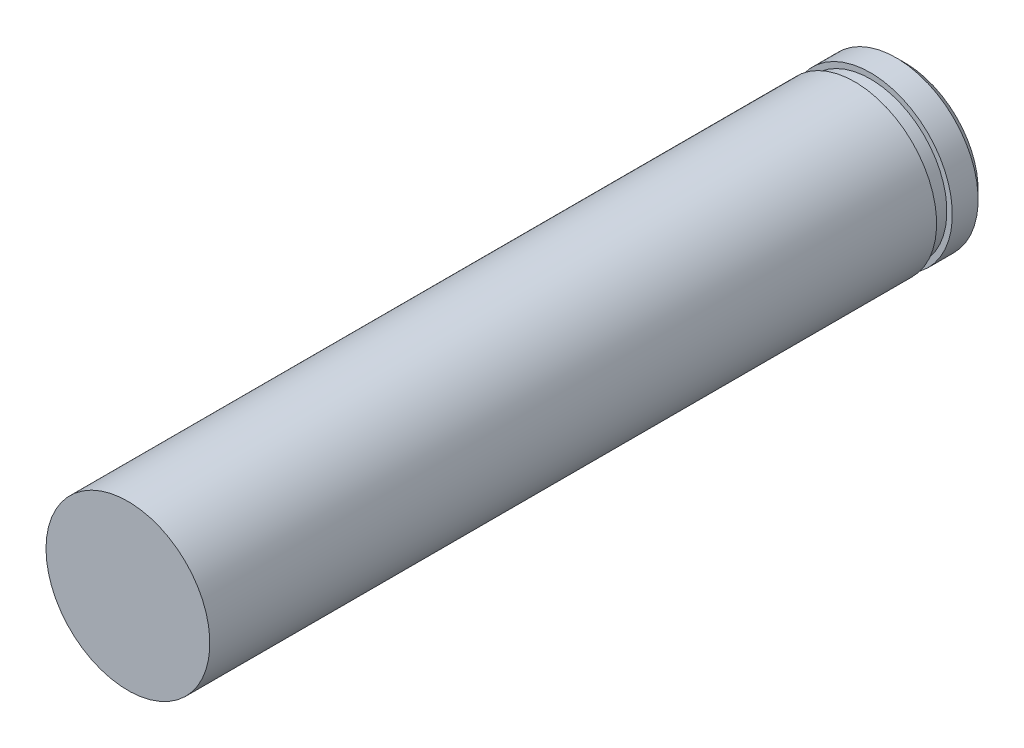
ISO-10303-21;
HEADER;
FILE_DESCRIPTION(('STEP AP214'),'2;1');
FILE_NAME('part.step','',(''),(''),'','','');
FILE_SCHEMA(('AUTOMOTIVE_DESIGN { 1 0 10303 214 1 1 1 1 }'));
ENDSEC;
DATA;
#1=APPLICATION_CONTEXT('core data for automotive mechanical design processes');
#2=APPLICATION_PROTOCOL_DEFINITION('international standard','automotive_design',2000,#1);
#3=PRODUCT_CONTEXT('',#1,'mechanical');
#4=PRODUCT('Part','Part','',(#3));
#5=PRODUCT_RELATED_PRODUCT_CATEGORY('part','',(#4));
#6=PRODUCT_DEFINITION_FORMATION('','',#4);
#7=PRODUCT_DEFINITION_CONTEXT('part definition',#1,'design');
#8=PRODUCT_DEFINITION('design','',#6,#7);
#9=PRODUCT_DEFINITION_SHAPE('','',#8);
#10=(LENGTH_UNIT() NAMED_UNIT(*) SI_UNIT(.MILLI.,.METRE.));
#11=(NAMED_UNIT(*) PLANE_ANGLE_UNIT() SI_UNIT($,.RADIAN.));
#12=(NAMED_UNIT(*) SI_UNIT($,.STERADIAN.) SOLID_ANGLE_UNIT());
#13=UNCERTAINTY_MEASURE_WITH_UNIT(LENGTH_MEASURE(1.E-05),#10,'distance_accuracy_value','');
#14=(GEOMETRIC_REPRESENTATION_CONTEXT(3) GLOBAL_UNCERTAINTY_ASSIGNED_CONTEXT((#13)) GLOBAL_UNIT_ASSIGNED_CONTEXT((#10,
#11,#12)) REPRESENTATION_CONTEXT('',''));
#15=CARTESIAN_POINT('',(0.,0.,0.));
#16=DIRECTION('',(0.,0.,1.));
#17=DIRECTION('',(1.,0.,0.));
#18=AXIS2_PLACEMENT_3D('',#15,#16,#17);
#19=CARTESIAN_POINT('',(0.,0.,0.));
#20=DIRECTION('',(0.,0.,1.));
#21=DIRECTION('',(1.,0.,0.));
#22=AXIS2_PLACEMENT_3D('',#19,#20,#21);
#23=PLANE('',#22);
#24=CARTESIAN_POINT('',(0.,0.,0.));
#25=DIRECTION('',(0.,0.,-1.));
#26=DIRECTION('',(-1.,0.,0.));
#27=AXIS2_PLACEMENT_3D('',#24,#25,#26);
#28=CIRCLE('',#27,2.38125);
#29=CARTESIAN_POINT('',(-2.38125,0.,0.));
#30=VERTEX_POINT('',#29);
#31=EDGE_CURVE('E56',#30,#30,#28,.T.);
#32=ORIENTED_EDGE('',*,*,#31,.F.);
#33=EDGE_LOOP('',(#32));
#34=FACE_BOUND('',#33,.T.);
#35=ADVANCED_FACE('F45',(#34),#23,.T.);
#36=CARTESIAN_POINT('',(0.,0.,0.));
#37=DIRECTION('',(0.,0.,-1.));
#38=DIRECTION('',(-1.,0.,0.));
#39=AXIS2_PLACEMENT_3D('',#36,#37,#38);
#40=CYLINDRICAL_SURFACE('',#39,2.38125);
#41=ORIENTED_EDGE('',*,*,#31,.T.);
#42=EDGE_LOOP('',(#41));
#43=FACE_BOUND('',#42,.T.);
#44=CARTESIAN_POINT('',(0.,0.,-21.12396));
#45=DIRECTION('',(0.,0.,-1.));
#46=DIRECTION('',(-1.,0.,0.));
#47=AXIS2_PLACEMENT_3D('',#44,#45,#46);
#48=CIRCLE('',#47,2.38125);
#49=CARTESIAN_POINT('',(-2.38125,0.,-21.12396));
#50=VERTEX_POINT('',#49);
#51=EDGE_CURVE('E60',#50,#50,#48,.T.);
#52=ORIENTED_EDGE('',*,*,#51,.F.);
#53=EDGE_LOOP('',(#52));
#54=FACE_BOUND('',#53,.T.);
#55=ADVANCED_FACE('F92',(#43,#54),#40,.T.);
#56=CARTESIAN_POINT('',(0.,2.38125,-21.12396));
#57=DIRECTION('',(0.,0.,-1.));
#58=DIRECTION('',(-1.,0.,0.));
#59=AXIS2_PLACEMENT_3D('',#56,#57,#58);
#60=PLANE('',#59);
#61=ORIENTED_EDGE('',*,*,#51,.T.);
#62=EDGE_LOOP('',(#61));
#63=FACE_BOUND('',#62,.T.);
#64=CARTESIAN_POINT('',(0.,0.,-21.12396));
#65=DIRECTION('',(0.,0.,-1.));
#66=DIRECTION('',(-1.,0.,0.));
#67=AXIS2_PLACEMENT_3D('',#64,#65,#66);
#68=CIRCLE('',#67,2.2225);
#69=CARTESIAN_POINT('',(-2.2225,0.,-21.12396));
#70=VERTEX_POINT('',#69);
#71=EDGE_CURVE('E65',#70,#70,#68,.T.);
#72=ORIENTED_EDGE('',*,*,#71,.F.);
#73=EDGE_LOOP('',(#72));
#74=FACE_BOUND('',#73,.T.);
#75=ADVANCED_FACE('F88',(#63,#74),#60,.T.);
#76=CARTESIAN_POINT('',(0.,0.,0.));
#77=DIRECTION('',(0.,0.,-1.));
#78=DIRECTION('',(-1.,0.,0.));
#79=AXIS2_PLACEMENT_3D('',#76,#77,#78);
#80=CYLINDRICAL_SURFACE('',#79,2.2225);
#81=ORIENTED_EDGE('',*,*,#71,.T.);
#82=EDGE_LOOP('',(#81));
#83=FACE_BOUND('',#82,.T.);
#84=CARTESIAN_POINT('',(0.,0.,-21.58116));
#85=DIRECTION('',(0.,0.,-1.));
#86=DIRECTION('',(-1.,0.,0.));
#87=AXIS2_PLACEMENT_3D('',#84,#85,#86);
#88=CIRCLE('',#87,2.2225);
#89=CARTESIAN_POINT('',(-2.2225,0.,-21.58116));
#90=VERTEX_POINT('',#89);
#91=EDGE_CURVE('E68',#90,#90,#88,.T.);
#92=ORIENTED_EDGE('',*,*,#91,.F.);
#93=EDGE_LOOP('',(#92));
#94=FACE_BOUND('',#93,.T.);
#95=ADVANCED_FACE('F79',(#83,#94),#80,.T.);
#96=CARTESIAN_POINT('',(0.,2.38125,-21.58116));
#97=DIRECTION('',(0.,0.,1.));
#98=DIRECTION('',(1.,0.,0.));
#99=AXIS2_PLACEMENT_3D('',#96,#97,#98);
#100=PLANE('',#99);
#101=ORIENTED_EDGE('',*,*,#91,.T.);
#102=EDGE_LOOP('',(#101));
#103=FACE_BOUND('',#102,.T.);
#104=CARTESIAN_POINT('',(0.,0.,-21.58116));
#105=DIRECTION('',(0.,0.,-1.));
#106=DIRECTION('',(-1.,0.,0.));
#107=AXIS2_PLACEMENT_3D('',#104,#105,#106);
#108=CIRCLE('',#107,2.38125);
#109=CARTESIAN_POINT('',(-2.38125,0.,-21.58116));
#110=VERTEX_POINT('',#109);
#111=EDGE_CURVE('E71',#110,#110,#108,.T.);
#112=ORIENTED_EDGE('',*,*,#111,.F.);
#113=EDGE_LOOP('',(#112));
#114=FACE_BOUND('',#113,.T.);
#115=ADVANCED_FACE('F77',(#103,#114),#100,.T.);
#116=CARTESIAN_POINT('',(0.,0.,0.));
#117=DIRECTION('',(0.,0.,-1.));
#118=DIRECTION('',(-1.,0.,0.));
#119=AXIS2_PLACEMENT_3D('',#116,#117,#118);
#120=CYLINDRICAL_SURFACE('',#119,2.38125);
#121=CARTESIAN_POINT('',(0.,0.,-22.33116));
#122=DIRECTION('',(0.,0.,-1.));
#123=DIRECTION('',(-1.,0.,0.));
#124=AXIS2_PLACEMENT_3D('',#121,#122,#123);
#125=CIRCLE('',#124,2.38125);
#126=CARTESIAN_POINT('',(-2.38125,0.,-22.33116));
#127=VERTEX_POINT('',#126);
#128=EDGE_CURVE('E12',#127,#127,#125,.F.);
#129=ORIENTED_EDGE('',*,*,#128,.T.);
#130=EDGE_LOOP('',(#129));
#131=FACE_BOUND('',#130,.T.);
#132=ORIENTED_EDGE('',*,*,#111,.T.);
#133=EDGE_LOOP('',(#132));
#134=FACE_BOUND('',#133,.T.);
#135=ADVANCED_FACE('F75',(#131,#134),#120,.T.);
#136=CARTESIAN_POINT('',(0.,0.,-22.58116));
#137=DIRECTION('',(0.,0.,-1.));
#138=DIRECTION('',(-1.,0.,0.));
#139=AXIS2_PLACEMENT_3D('',#136,#137,#138);
#140=PLANE('',#139);
#141=CARTESIAN_POINT('',(0.,0.,-22.58116));
#142=DIRECTION('',(0.,0.,-1.));
#143=DIRECTION('',(-1.,0.,0.));
#144=AXIS2_PLACEMENT_3D('',#141,#142,#143);
#145=CIRCLE('',#144,2.13125);
#146=CARTESIAN_POINT('',(-2.13125,0.,-22.58116));
#147=VERTEX_POINT('',#146);
#148=EDGE_CURVE('E52',#147,#147,#145,.T.);
#149=ORIENTED_EDGE('',*,*,#148,.T.);
#150=EDGE_LOOP('',(#149));
#151=FACE_BOUND('',#150,.T.);
#152=ADVANCED_FACE('F86',(#151),#140,.T.);
#153=CARTESIAN_POINT('',(0.,0.,-22.58116));
#154=DIRECTION('',(0.,0.,1.));
#155=DIRECTION('',(1.,0.,0.));
#156=AXIS2_PLACEMENT_3D('',#153,#154,#155);
#157=CONICAL_SURFACE('',#156,2.13125,0.785398163397446);
#158=ORIENTED_EDGE('',*,*,#128,.F.);
#159=EDGE_LOOP('',(#158));
#160=FACE_BOUND('',#159,.T.);
#161=ORIENTED_EDGE('',*,*,#148,.F.);
#162=EDGE_LOOP('',(#161));
#163=FACE_BOUND('',#162,.T.);
#164=ADVANCED_FACE('F47',(#160,#163),#157,.T.);
#165=CLOSED_SHELL('',(#35,#55,#75,#95,#115,#135,#152,#164));
#166=MANIFOLD_SOLID_BREP('B2',#165);
#167=ADVANCED_BREP_SHAPE_REPRESENTATION('',(#18,#166),#14);
#168=SHAPE_DEFINITION_REPRESENTATION(#9,#167);
ENDSEC;
END-ISO-10303-21;
